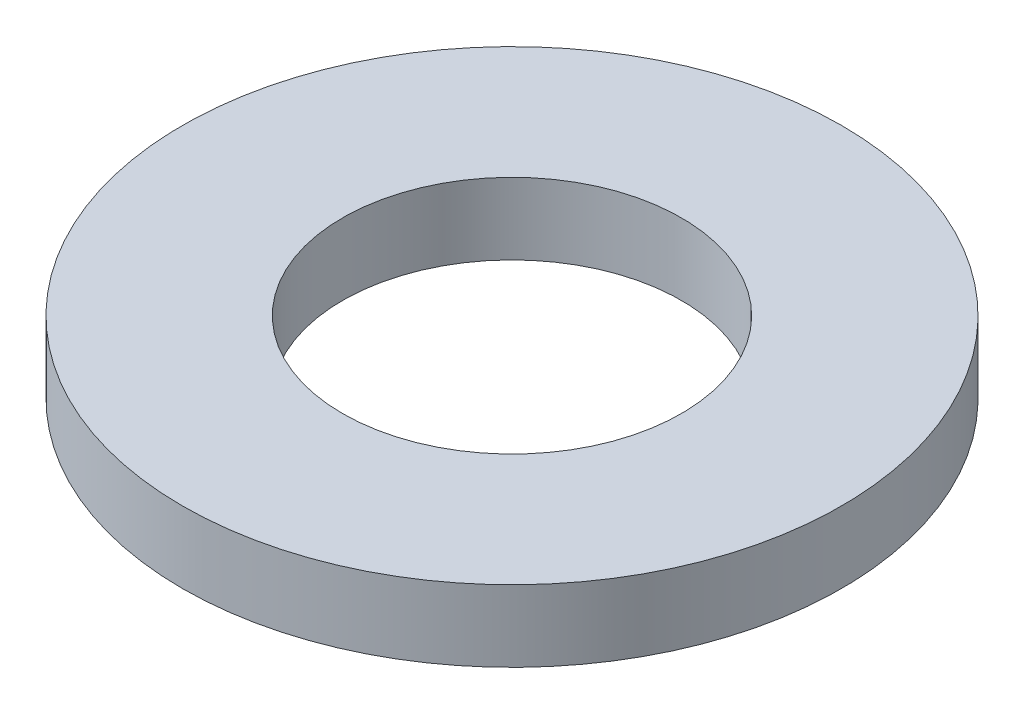
ISO-10303-21;
HEADER;
FILE_DESCRIPTION(('STEP AP214'),'2;1');
FILE_NAME('part.step','',(''),(''),'','','');
FILE_SCHEMA(('AUTOMOTIVE_DESIGN { 1 0 10303 214 1 1 1 1 }'));
ENDSEC;
DATA;
#1=APPLICATION_CONTEXT('core data for automotive mechanical design processes');
#2=APPLICATION_PROTOCOL_DEFINITION('international standard','automotive_design',2000,#1);
#3=PRODUCT_CONTEXT('',#1,'mechanical');
#4=PRODUCT('Part','Part','',(#3));
#5=PRODUCT_RELATED_PRODUCT_CATEGORY('part','',(#4));
#6=PRODUCT_DEFINITION_FORMATION('','',#4);
#7=PRODUCT_DEFINITION_CONTEXT('part definition',#1,'design');
#8=PRODUCT_DEFINITION('design','',#6,#7);
#9=PRODUCT_DEFINITION_SHAPE('','',#8);
#10=(LENGTH_UNIT() NAMED_UNIT(*) SI_UNIT(.MILLI.,.METRE.));
#11=(NAMED_UNIT(*) PLANE_ANGLE_UNIT() SI_UNIT($,.RADIAN.));
#12=(NAMED_UNIT(*) SI_UNIT($,.STERADIAN.) SOLID_ANGLE_UNIT());
#13=UNCERTAINTY_MEASURE_WITH_UNIT(LENGTH_MEASURE(1.E-05),#10,'distance_accuracy_value','');
#14=(GEOMETRIC_REPRESENTATION_CONTEXT(3) GLOBAL_UNCERTAINTY_ASSIGNED_CONTEXT((#13)) GLOBAL_UNIT_ASSIGNED_CONTEXT((#10,
#11,#12)) REPRESENTATION_CONTEXT('',''));
#15=CARTESIAN_POINT('',(0.,0.,0.));
#16=DIRECTION('',(0.,0.,1.));
#17=DIRECTION('',(1.,0.,0.));
#18=AXIS2_PLACEMENT_3D('',#15,#16,#17);
#19=CARTESIAN_POINT('',(0.,19.,0.));
#20=DIRECTION('',(0.,-1.,0.));
#21=DIRECTION('',(0.,0.,-1.));
#22=AXIS2_PLACEMENT_3D('',#19,#20,#21);
#23=CYLINDRICAL_SURFACE('',#22,87.5);
#24=CARTESIAN_POINT('',(0.,19.,0.));
#25=DIRECTION('',(0.,1.,0.));
#26=DIRECTION('',(0.,0.,1.));
#27=AXIS2_PLACEMENT_3D('',#24,#25,#26);
#28=CIRCLE('',#27,87.5);
#29=CARTESIAN_POINT('',(0.,19.,87.5));
#30=VERTEX_POINT('',#29);
#31=EDGE_CURVE('E10',#30,#30,#28,.T.);
#32=ORIENTED_EDGE('',*,*,#31,.F.);
#33=EDGE_LOOP('',(#32));
#34=FACE_BOUND('',#33,.T.);
#35=CARTESIAN_POINT('',(0.,0.,0.));
#36=DIRECTION('',(0.,1.,0.));
#37=DIRECTION('',(0.,0.,1.));
#38=AXIS2_PLACEMENT_3D('',#35,#36,#37);
#39=CIRCLE('',#38,87.5);
#40=CARTESIAN_POINT('',(0.,0.,87.5));
#41=VERTEX_POINT('',#40);
#42=EDGE_CURVE('E37',#41,#41,#39,.T.);
#43=ORIENTED_EDGE('',*,*,#42,.T.);
#44=EDGE_LOOP('',(#43));
#45=FACE_BOUND('',#44,.T.);
#46=ADVANCED_FACE('F40',(#34,#45),#23,.T.);
#47=CARTESIAN_POINT('',(0.,19.,0.));
#48=DIRECTION('',(0.,1.,0.));
#49=DIRECTION('',(0.,0.,1.));
#50=AXIS2_PLACEMENT_3D('',#47,#48,#49);
#51=PLANE('',#50);
#52=CARTESIAN_POINT('',(0.,19.,0.));
#53=DIRECTION('',(0.,1.,0.));
#54=DIRECTION('',(0.,0.,1.));
#55=AXIS2_PLACEMENT_3D('',#52,#53,#54);
#56=CIRCLE('',#55,45.);
#57=CARTESIAN_POINT('',(0.,19.,45.));
#58=VERTEX_POINT('',#57);
#59=EDGE_CURVE('E50',#58,#58,#56,.T.);
#60=ORIENTED_EDGE('',*,*,#59,.F.);
#61=EDGE_LOOP('',(#60));
#62=FACE_BOUND('',#61,.T.);
#63=ORIENTED_EDGE('',*,*,#31,.T.);
#64=EDGE_LOOP('',(#63));
#65=FACE_BOUND('',#64,.T.);
#66=ADVANCED_FACE('F59',(#62,#65),#51,.T.);
#67=CARTESIAN_POINT('',(0.,0.,0.));
#68=DIRECTION('',(0.,1.,0.));
#69=DIRECTION('',(0.,0.,1.));
#70=AXIS2_PLACEMENT_3D('',#67,#68,#69);
#71=PLANE('',#70);
#72=CARTESIAN_POINT('',(0.,0.,0.));
#73=DIRECTION('',(0.,1.,0.));
#74=DIRECTION('',(0.,0.,1.));
#75=AXIS2_PLACEMENT_3D('',#72,#73,#74);
#76=CIRCLE('',#75,45.);
#77=CARTESIAN_POINT('',(0.,0.,45.));
#78=VERTEX_POINT('',#77);
#79=EDGE_CURVE('E47',#78,#78,#76,.T.);
#80=ORIENTED_EDGE('',*,*,#79,.T.);
#81=EDGE_LOOP('',(#80));
#82=FACE_BOUND('',#81,.T.);
#83=ORIENTED_EDGE('',*,*,#42,.F.);
#84=EDGE_LOOP('',(#83));
#85=FACE_BOUND('',#84,.T.);
#86=ADVANCED_FACE('F58',(#82,#85),#71,.F.);
#87=CARTESIAN_POINT('',(0.,19.,0.));
#88=DIRECTION('',(0.,-1.,0.));
#89=DIRECTION('',(0.,0.,-1.));
#90=AXIS2_PLACEMENT_3D('',#87,#88,#89);
#91=CYLINDRICAL_SURFACE('',#90,45.);
#92=ORIENTED_EDGE('',*,*,#59,.T.);
#93=EDGE_LOOP('',(#92));
#94=FACE_BOUND('',#93,.T.);
#95=ORIENTED_EDGE('',*,*,#79,.F.);
#96=EDGE_LOOP('',(#95));
#97=FACE_BOUND('',#96,.T.);
#98=ADVANCED_FACE('F54',(#94,#97),#91,.F.);
#99=CLOSED_SHELL('',(#46,#66,#86,#98));
#100=MANIFOLD_SOLID_BREP('B2',#99);
#101=ADVANCED_BREP_SHAPE_REPRESENTATION('',(#18,#100),#14);
#102=SHAPE_DEFINITION_REPRESENTATION(#9,#101);
ENDSEC;
END-ISO-10303-21;
